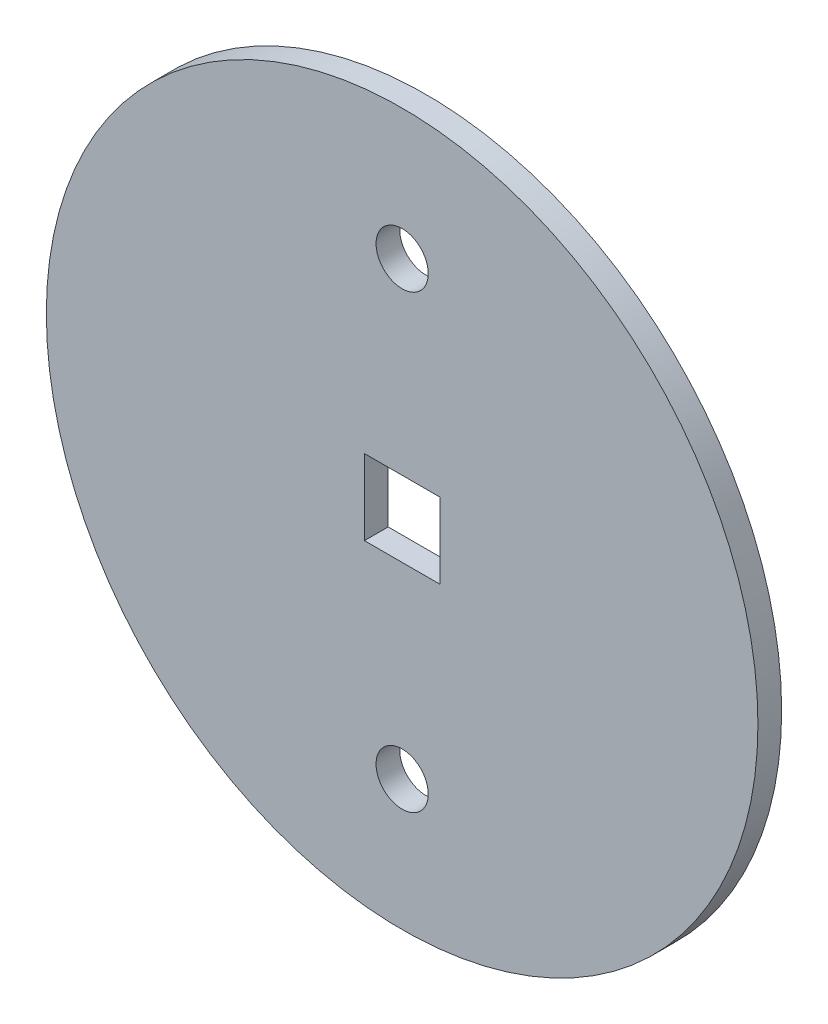
ISO-10303-21;
HEADER;
FILE_DESCRIPTION(('STEP AP214'),'2;1');
FILE_NAME('part.step','',(''),(''),'','','');
FILE_SCHEMA(('AUTOMOTIVE_DESIGN { 1 0 10303 214 1 1 1 1 }'));
ENDSEC;
DATA;
#1=APPLICATION_CONTEXT('core data for automotive mechanical design processes');
#2=APPLICATION_PROTOCOL_DEFINITION('international standard','automotive_design',2000,#1);
#3=PRODUCT_CONTEXT('',#1,'mechanical');
#4=PRODUCT('Part','Part','',(#3));
#5=PRODUCT_RELATED_PRODUCT_CATEGORY('part','',(#4));
#6=PRODUCT_DEFINITION_FORMATION('','',#4);
#7=PRODUCT_DEFINITION_CONTEXT('part definition',#1,'design');
#8=PRODUCT_DEFINITION('design','',#6,#7);
#9=PRODUCT_DEFINITION_SHAPE('','',#8);
#10=(LENGTH_UNIT() NAMED_UNIT(*) SI_UNIT(.MILLI.,.METRE.));
#11=(NAMED_UNIT(*) PLANE_ANGLE_UNIT() SI_UNIT($,.RADIAN.));
#12=(NAMED_UNIT(*) SI_UNIT($,.STERADIAN.) SOLID_ANGLE_UNIT());
#13=UNCERTAINTY_MEASURE_WITH_UNIT(LENGTH_MEASURE(1.E-05),#10,'distance_accuracy_value','');
#14=(GEOMETRIC_REPRESENTATION_CONTEXT(3) GLOBAL_UNCERTAINTY_ASSIGNED_CONTEXT((#13)) GLOBAL_UNIT_ASSIGNED_CONTEXT((#10,
#11,#12)) REPRESENTATION_CONTEXT('',''));
#15=CARTESIAN_POINT('',(0.,0.,0.));
#16=DIRECTION('',(0.,0.,1.));
#17=DIRECTION('',(1.,0.,0.));
#18=AXIS2_PLACEMENT_3D('',#15,#16,#17);
#19=CARTESIAN_POINT('',(0.,0.,-1.));
#20=DIRECTION('',(0.,0.,1.));
#21=DIRECTION('',(1.,0.,0.));
#22=AXIS2_PLACEMENT_3D('',#19,#20,#21);
#23=CYLINDRICAL_SURFACE('',#22,15.);
#24=CARTESIAN_POINT('',(0.,0.,-1.));
#25=DIRECTION('',(0.,0.,1.));
#26=DIRECTION('',(1.,0.,0.));
#27=AXIS2_PLACEMENT_3D('',#24,#25,#26);
#28=CIRCLE('',#27,15.);
#29=CARTESIAN_POINT('',(15.,0.,-1.));
#30=VERTEX_POINT('',#29);
#31=EDGE_CURVE('E11',#30,#30,#28,.T.);
#32=ORIENTED_EDGE('',*,*,#31,.T.);
#33=EDGE_LOOP('',(#32));
#34=FACE_BOUND('',#33,.T.);
#35=CARTESIAN_POINT('',(0.,0.,0.));
#36=DIRECTION('',(0.,0.,1.));
#37=DIRECTION('',(1.,0.,0.));
#38=AXIS2_PLACEMENT_3D('',#35,#36,#37);
#39=CIRCLE('',#38,15.);
#40=CARTESIAN_POINT('',(15.,0.,0.));
#41=VERTEX_POINT('',#40);
#42=EDGE_CURVE('E41',#41,#41,#39,.T.);
#43=ORIENTED_EDGE('',*,*,#42,.F.);
#44=EDGE_LOOP('',(#43));
#45=FACE_BOUND('',#44,.T.);
#46=ADVANCED_FACE('F38',(#34,#45),#23,.T.);
#47=CARTESIAN_POINT('',(0.,0.,-1.));
#48=DIRECTION('',(0.,0.,1.));
#49=DIRECTION('',(1.,0.,0.));
#50=AXIS2_PLACEMENT_3D('',#47,#48,#49);
#51=PLANE('',#50);
#52=CARTESIAN_POINT('',(0.,-9.5,-1.));
#53=DIRECTION('',(0.,0.,1.));
#54=DIRECTION('',(1.,0.,0.));
#55=AXIS2_PLACEMENT_3D('',#52,#53,#54);
#56=CIRCLE('',#55,1.1);
#57=CARTESIAN_POINT('',(1.1,-9.5,-1.));
#58=VERTEX_POINT('',#57);
#59=EDGE_CURVE('E108',#58,#58,#56,.T.);
#60=ORIENTED_EDGE('',*,*,#59,.T.);
#61=EDGE_LOOP('',(#60));
#62=FACE_BOUND('',#61,.T.);
#63=DIRECTION('',(0.,-1.,0.));
#64=VECTOR('',#63,1.);
#65=CARTESIAN_POINT('',(-1.59,1.59,-1.));
#66=LINE('',#65,#64);
#67=CARTESIAN_POINT('',(-1.59,1.59,-1.));
#68=VERTEX_POINT('',#67);
#69=CARTESIAN_POINT('',(-1.59,-1.59,-1.));
#70=VERTEX_POINT('',#69);
#71=EDGE_CURVE('E88',#68,#70,#66,.T.);
#72=ORIENTED_EDGE('',*,*,#71,.T.);
#73=DIRECTION('',(1.,0.,0.));
#74=VECTOR('',#73,1.);
#75=CARTESIAN_POINT('',(-1.59,-1.59,-1.));
#76=LINE('',#75,#74);
#77=CARTESIAN_POINT('',(1.59,-1.59,-1.));
#78=VERTEX_POINT('',#77);
#79=EDGE_CURVE('E93',#70,#78,#76,.T.);
#80=ORIENTED_EDGE('',*,*,#79,.T.);
#81=DIRECTION('',(0.,1.,0.));
#82=VECTOR('',#81,1.);
#83=CARTESIAN_POINT('',(1.59,0.,-1.));
#84=LINE('',#83,#82);
#85=CARTESIAN_POINT('',(1.59,1.59,-1.));
#86=VERTEX_POINT('',#85);
#87=EDGE_CURVE('E99',#78,#86,#84,.T.);
#88=ORIENTED_EDGE('',*,*,#87,.T.);
#89=DIRECTION('',(-1.,0.,0.));
#90=VECTOR('',#89,1.);
#91=CARTESIAN_POINT('',(1.59,1.59,-1.));
#92=LINE('',#91,#90);
#93=EDGE_CURVE('E52',#86,#68,#92,.T.);
#94=ORIENTED_EDGE('',*,*,#93,.T.);
#95=EDGE_LOOP('',(#72,#80,#88,#94));
#96=FACE_BOUND('',#95,.T.);
#97=CARTESIAN_POINT('',(0.,9.5,-1.));
#98=DIRECTION('',(0.,0.,1.));
#99=DIRECTION('',(1.,0.,0.));
#100=AXIS2_PLACEMENT_3D('',#97,#98,#99);
#101=CIRCLE('',#100,1.1);
#102=CARTESIAN_POINT('',(1.1,9.5,-1.));
#103=VERTEX_POINT('',#102);
#104=EDGE_CURVE('E118',#103,#103,#101,.T.);
#105=ORIENTED_EDGE('',*,*,#104,.T.);
#106=EDGE_LOOP('',(#105));
#107=FACE_BOUND('',#106,.T.);
#108=ORIENTED_EDGE('',*,*,#31,.F.);
#109=EDGE_LOOP('',(#108));
#110=FACE_BOUND('',#109,.T.);
#111=ADVANCED_FACE('F96',(#62,#96,#107,#110),#51,.F.);
#112=CARTESIAN_POINT('',(0.,0.,0.));
#113=DIRECTION('',(0.,0.,1.));
#114=DIRECTION('',(1.,0.,0.));
#115=AXIS2_PLACEMENT_3D('',#112,#113,#114);
#116=PLANE('',#115);
#117=CARTESIAN_POINT('',(0.,-9.5,0.));
#118=DIRECTION('',(0.,0.,1.));
#119=DIRECTION('',(1.,0.,0.));
#120=AXIS2_PLACEMENT_3D('',#117,#118,#119);
#121=CIRCLE('',#120,1.1);
#122=CARTESIAN_POINT('',(1.1,-9.5,0.));
#123=VERTEX_POINT('',#122);
#124=EDGE_CURVE('E169',#123,#123,#121,.T.);
#125=ORIENTED_EDGE('',*,*,#124,.F.);
#126=EDGE_LOOP('',(#125));
#127=FACE_BOUND('',#126,.T.);
#128=DIRECTION('',(1.,0.,0.));
#129=VECTOR('',#128,1.);
#130=CARTESIAN_POINT('',(-1.59,-1.59,0.));
#131=LINE('',#130,#129);
#132=CARTESIAN_POINT('',(-1.59,-1.59,0.));
#133=VERTEX_POINT('',#132);
#134=CARTESIAN_POINT('',(1.59,-1.59,0.));
#135=VERTEX_POINT('',#134);
#136=EDGE_CURVE('E60',#133,#135,#131,.T.);
#137=ORIENTED_EDGE('',*,*,#136,.F.);
#138=DIRECTION('',(0.,-1.,0.));
#139=VECTOR('',#138,1.);
#140=CARTESIAN_POINT('',(-1.59,1.59,0.));
#141=LINE('',#140,#139);
#142=CARTESIAN_POINT('',(-1.59,1.59,0.));
#143=VERTEX_POINT('',#142);
#144=EDGE_CURVE('E110',#143,#133,#141,.T.);
#145=ORIENTED_EDGE('',*,*,#144,.F.);
#146=DIRECTION('',(-1.,0.,0.));
#147=VECTOR('',#146,1.);
#148=CARTESIAN_POINT('',(1.59,1.59,0.));
#149=LINE('',#148,#147);
#150=CARTESIAN_POINT('',(1.59,1.59,0.));
#151=VERTEX_POINT('',#150);
#152=EDGE_CURVE('E80',#151,#143,#149,.T.);
#153=ORIENTED_EDGE('',*,*,#152,.F.);
#154=DIRECTION('',(0.,1.,0.));
#155=VECTOR('',#154,1.);
#156=CARTESIAN_POINT('',(1.59,0.,0.));
#157=LINE('',#156,#155);
#158=EDGE_CURVE('E105',#135,#151,#157,.T.);
#159=ORIENTED_EDGE('',*,*,#158,.F.);
#160=EDGE_LOOP('',(#137,#145,#153,#159));
#161=FACE_BOUND('',#160,.T.);
#162=CARTESIAN_POINT('',(0.,9.5,0.));
#163=DIRECTION('',(0.,0.,1.));
#164=DIRECTION('',(1.,0.,0.));
#165=AXIS2_PLACEMENT_3D('',#162,#163,#164);
#166=CIRCLE('',#165,1.1);
#167=CARTESIAN_POINT('',(1.1,9.5,0.));
#168=VERTEX_POINT('',#167);
#169=EDGE_CURVE('E115',#168,#168,#166,.T.);
#170=ORIENTED_EDGE('',*,*,#169,.F.);
#171=EDGE_LOOP('',(#170));
#172=FACE_BOUND('',#171,.T.);
#173=ORIENTED_EDGE('',*,*,#42,.T.);
#174=EDGE_LOOP('',(#173));
#175=FACE_BOUND('',#174,.T.);
#176=ADVANCED_FACE('F126',(#127,#161,#172,#175),#116,.T.);
#177=CARTESIAN_POINT('',(0.,9.5,-1.));
#178=DIRECTION('',(0.,0.,1.));
#179=DIRECTION('',(1.,0.,0.));
#180=AXIS2_PLACEMENT_3D('',#177,#178,#179);
#181=CYLINDRICAL_SURFACE('',#180,1.1);
#182=ORIENTED_EDGE('',*,*,#104,.F.);
#183=EDGE_LOOP('',(#182));
#184=FACE_BOUND('',#183,.T.);
#185=ORIENTED_EDGE('',*,*,#169,.T.);
#186=EDGE_LOOP('',(#185));
#187=FACE_BOUND('',#186,.T.);
#188=ADVANCED_FACE('F124',(#184,#187),#181,.F.);
#189=CARTESIAN_POINT('',(-1.59,-1.59,-1.));
#190=DIRECTION('',(0.,-1.,0.));
#191=DIRECTION('',(0.,0.,-1.));
#192=AXIS2_PLACEMENT_3D('',#189,#190,#191);
#193=PLANE('',#192);
#194=ORIENTED_EDGE('',*,*,#136,.T.);
#195=DIRECTION('',(0.,0.,1.));
#196=VECTOR('',#195,1.);
#197=CARTESIAN_POINT('',(1.59,-1.59,-1.));
#198=LINE('',#197,#196);
#199=EDGE_CURVE('E113',#78,#135,#198,.T.);
#200=ORIENTED_EDGE('',*,*,#199,.F.);
#201=ORIENTED_EDGE('',*,*,#79,.F.);
#202=DIRECTION('',(0.,0.,1.));
#203=VECTOR('',#202,1.);
#204=CARTESIAN_POINT('',(-1.59,-1.59,-1.));
#205=LINE('',#204,#203);
#206=EDGE_CURVE('E84',#70,#133,#205,.T.);
#207=ORIENTED_EDGE('',*,*,#206,.T.);
#208=EDGE_LOOP('',(#194,#200,#201,#207));
#209=FACE_BOUND('',#208,.T.);
#210=ADVANCED_FACE('F148',(#209),#193,.F.);
#211=CARTESIAN_POINT('',(-1.59,1.59,-1.));
#212=DIRECTION('',(-1.,0.,0.));
#213=DIRECTION('',(0.,0.,1.));
#214=AXIS2_PLACEMENT_3D('',#211,#212,#213);
#215=PLANE('',#214);
#216=ORIENTED_EDGE('',*,*,#144,.T.);
#217=ORIENTED_EDGE('',*,*,#206,.F.);
#218=ORIENTED_EDGE('',*,*,#71,.F.);
#219=DIRECTION('',(0.,0.,1.));
#220=VECTOR('',#219,1.);
#221=CARTESIAN_POINT('',(-1.59,1.59,-1.));
#222=LINE('',#221,#220);
#223=EDGE_CURVE('E76',#68,#143,#222,.T.);
#224=ORIENTED_EDGE('',*,*,#223,.T.);
#225=EDGE_LOOP('',(#216,#217,#218,#224));
#226=FACE_BOUND('',#225,.T.);
#227=ADVANCED_FACE('F89',(#226),#215,.F.);
#228=CARTESIAN_POINT('',(1.59,1.59,-1.));
#229=DIRECTION('',(0.,1.,0.));
#230=DIRECTION('',(0.,0.,1.));
#231=AXIS2_PLACEMENT_3D('',#228,#229,#230);
#232=PLANE('',#231);
#233=ORIENTED_EDGE('',*,*,#152,.T.);
#234=ORIENTED_EDGE('',*,*,#223,.F.);
#235=ORIENTED_EDGE('',*,*,#93,.F.);
#236=DIRECTION('',(0.,0.,1.));
#237=VECTOR('',#236,1.);
#238=CARTESIAN_POINT('',(1.59,1.59,-1.));
#239=LINE('',#238,#237);
#240=EDGE_CURVE('E85',#86,#151,#239,.T.);
#241=ORIENTED_EDGE('',*,*,#240,.T.);
#242=EDGE_LOOP('',(#233,#234,#235,#241));
#243=FACE_BOUND('',#242,.T.);
#244=ADVANCED_FACE('F78',(#243),#232,.F.);
#245=CARTESIAN_POINT('',(1.59,0.,-1.));
#246=DIRECTION('',(1.,0.,0.));
#247=DIRECTION('',(0.,0.,-1.));
#248=AXIS2_PLACEMENT_3D('',#245,#246,#247);
#249=PLANE('',#248);
#250=ORIENTED_EDGE('',*,*,#158,.T.);
#251=ORIENTED_EDGE('',*,*,#240,.F.);
#252=ORIENTED_EDGE('',*,*,#87,.F.);
#253=ORIENTED_EDGE('',*,*,#199,.T.);
#254=EDGE_LOOP('',(#250,#251,#252,#253));
#255=FACE_BOUND('',#254,.T.);
#256=ADVANCED_FACE('F150',(#255),#249,.F.);
#257=CARTESIAN_POINT('',(0.,-9.5,-1.));
#258=DIRECTION('',(0.,0.,1.));
#259=DIRECTION('',(1.,0.,0.));
#260=AXIS2_PLACEMENT_3D('',#257,#258,#259);
#261=CYLINDRICAL_SURFACE('',#260,1.1);
#262=ORIENTED_EDGE('',*,*,#59,.F.);
#263=EDGE_LOOP('',(#262));
#264=FACE_BOUND('',#263,.T.);
#265=ORIENTED_EDGE('',*,*,#124,.T.);
#266=EDGE_LOOP('',(#265));
#267=FACE_BOUND('',#266,.T.);
#268=ADVANCED_FACE('F153',(#264,#267),#261,.F.);
#269=CLOSED_SHELL('',(#46,#111,#176,#188,#210,#227,#244,#256,#268));
#270=MANIFOLD_SOLID_BREP('B2',#269);
#271=ADVANCED_BREP_SHAPE_REPRESENTATION('',(#18,#270),#14);
#272=SHAPE_DEFINITION_REPRESENTATION(#9,#271);
ENDSEC;
END-ISO-10303-21;
